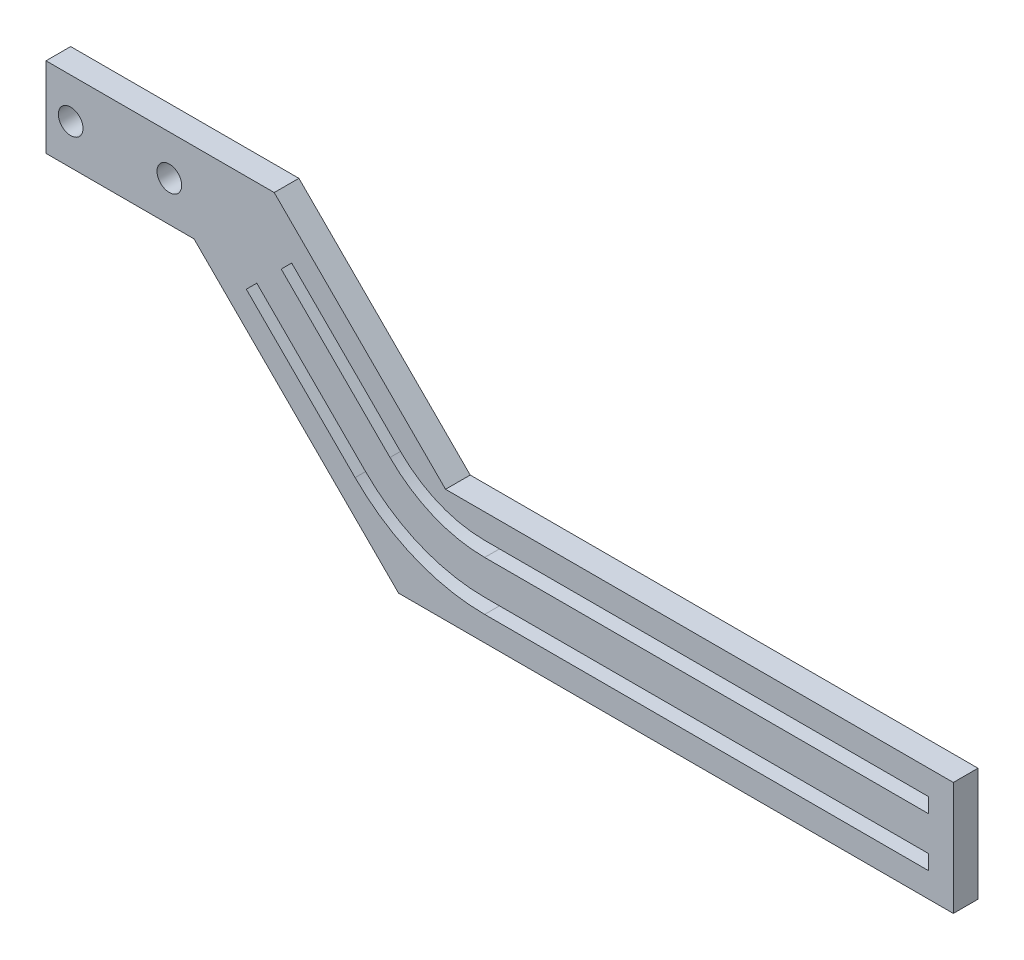
ISO-10303-21;
HEADER;
FILE_DESCRIPTION(('STEP AP214'),'2;1');
FILE_NAME('part.step','',(''),(''),'','','');
FILE_SCHEMA(('AUTOMOTIVE_DESIGN { 1 0 10303 214 1 1 1 1 }'));
ENDSEC;
DATA;
#1=APPLICATION_CONTEXT('core data for automotive mechanical design processes');
#2=APPLICATION_PROTOCOL_DEFINITION('international standard','automotive_design',2000,#1);
#3=PRODUCT_CONTEXT('',#1,'mechanical');
#4=PRODUCT('Part','Part','',(#3));
#5=PRODUCT_RELATED_PRODUCT_CATEGORY('part','',(#4));
#6=PRODUCT_DEFINITION_FORMATION('','',#4);
#7=PRODUCT_DEFINITION_CONTEXT('part definition',#1,'design');
#8=PRODUCT_DEFINITION('design','',#6,#7);
#9=PRODUCT_DEFINITION_SHAPE('','',#8);
#10=(LENGTH_UNIT() NAMED_UNIT(*) SI_UNIT(.MILLI.,.METRE.));
#11=(NAMED_UNIT(*) PLANE_ANGLE_UNIT() SI_UNIT($,.RADIAN.));
#12=(NAMED_UNIT(*) SI_UNIT($,.STERADIAN.) SOLID_ANGLE_UNIT());
#13=UNCERTAINTY_MEASURE_WITH_UNIT(LENGTH_MEASURE(1.E-05),#10,'distance_accuracy_value','');
#14=(GEOMETRIC_REPRESENTATION_CONTEXT(3) GLOBAL_UNCERTAINTY_ASSIGNED_CONTEXT((#13)) GLOBAL_UNIT_ASSIGNED_CONTEXT((#10,
#11,#12)) REPRESENTATION_CONTEXT('',''));
#15=CARTESIAN_POINT('',(0.,0.,0.));
#16=DIRECTION('',(0.,0.,1.));
#17=DIRECTION('',(1.,0.,0.));
#18=AXIS2_PLACEMENT_3D('',#15,#16,#17);
#19=CARTESIAN_POINT('',(0.,0.,5.));
#20=DIRECTION('',(0.,0.,-1.));
#21=DIRECTION('',(-1.,0.,0.));
#22=AXIS2_PLACEMENT_3D('',#19,#20,#21);
#23=PLANE('',#22);
#24=DIRECTION('',(-0.707106781186554,-0.707106781186541,0.));
#25=VECTOR('',#24,1.);
#26=CARTESIAN_POINT('',(-29.9999999999996,30.,5.));
#27=LINE('',#26,#25);
#28=CARTESIAN_POINT('',(-27.8786796564399,32.1213203435596,5.));
#29=VERTEX_POINT('',#28);
#30=CARTESIAN_POINT('',(-29.9999999999996,30.,5.));
#31=VERTEX_POINT('',#30);
#32=EDGE_CURVE('E263',#29,#31,#27,.T.);
#33=ORIENTED_EDGE('',*,*,#32,.F.);
#34=DIRECTION('',(-0.707106781186543,0.707106781186552,0.));
#35=VECTOR('',#34,1.);
#36=CARTESIAN_POINT('',(-27.8786796564399,32.1213203435596,5.));
#37=LINE('',#36,#35);
#38=CARTESIAN_POINT('',(-5.82842712474613,10.0710678118655,5.));
#39=VERTEX_POINT('',#38);
#40=EDGE_CURVE('E279',#39,#29,#37,.T.);
#41=ORIENTED_EDGE('',*,*,#40,.F.);
#42=CARTESIAN_POINT('',(11.2426406871193,27.1421356237307,5.));
#43=DIRECTION('',(0.,0.,-1.));
#44=DIRECTION('',(-1.,0.,0.));
#45=AXIS2_PLACEMENT_3D('',#42,#43,#44);
#46=CIRCLE('',#45,24.1421356237307);
#47=CARTESIAN_POINT('',(11.2426406871193,3.,5.));
#48=VERTEX_POINT('',#47);
#49=EDGE_CURVE('E276',#48,#39,#46,.T.);
#50=ORIENTED_EDGE('',*,*,#49,.F.);
#51=DIRECTION('',(-1.,0.,0.));
#52=VECTOR('',#51,1.);
#53=CARTESIAN_POINT('',(11.2426406871193,3.,5.));
#54=LINE('',#53,#52);
#55=CARTESIAN_POINT('',(101.242640687119,3.,5.));
#56=VERTEX_POINT('',#55);
#57=EDGE_CURVE('E274',#56,#48,#54,.T.);
#58=ORIENTED_EDGE('',*,*,#57,.F.);
#59=DIRECTION('',(0.,1.,0.));
#60=VECTOR('',#59,1.);
#61=CARTESIAN_POINT('',(101.242640687119,3.,5.));
#62=LINE('',#61,#60);
#63=CARTESIAN_POINT('',(101.242640687119,0.,5.));
#64=VERTEX_POINT('',#63);
#65=EDGE_CURVE('E272',#64,#56,#62,.T.);
#66=ORIENTED_EDGE('',*,*,#65,.F.);
#67=DIRECTION('',(1.,0.,0.));
#68=VECTOR('',#67,1.);
#69=CARTESIAN_POINT('',(101.242640687119,0.,5.));
#70=LINE('',#69,#68);
#71=CARTESIAN_POINT('',(11.2426406871193,0.,5.));
#72=VERTEX_POINT('',#71);
#73=EDGE_CURVE('E270',#72,#64,#70,.T.);
#74=ORIENTED_EDGE('',*,*,#73,.F.);
#75=CARTESIAN_POINT('',(11.2426406871193,27.1421356237307,5.));
#76=DIRECTION('',(0.,0.,1.));
#77=DIRECTION('',(-1.,0.,0.));
#78=AXIS2_PLACEMENT_3D('',#75,#76,#77);
#79=CIRCLE('',#78,27.1421356237307);
#80=CARTESIAN_POINT('',(-7.94974746830579,7.94974746830589,5.));
#81=VERTEX_POINT('',#80);
#82=EDGE_CURVE('E268',#81,#72,#79,.T.);
#83=ORIENTED_EDGE('',*,*,#82,.F.);
#84=DIRECTION('',(0.707106781186543,-0.707106781186552,0.));
#85=VECTOR('',#84,1.);
#86=CARTESIAN_POINT('',(-7.94974746830578,7.94974746830589,5.));
#87=LINE('',#86,#85);
#88=EDGE_CURVE('E265',#31,#81,#87,.T.);
#89=ORIENTED_EDGE('',*,*,#88,.F.);
#90=EDGE_LOOP('',(#33,#41,#50,#58,#66,#74,#83,#89));
#91=FACE_BOUND('',#90,.T.);
#92=DIRECTION('',(1.,0.,0.));
#93=VECTOR('',#92,1.);
#94=CARTESIAN_POINT('',(-77.6776695296633,26.4644660940673,5.));
#95=LINE('',#94,#93);
#96=CARTESIAN_POINT('',(-77.6776695296633,26.4644660940673,5.));
#97=VERTEX_POINT('',#96);
#98=CARTESIAN_POINT('',(-47.6776695296633,26.4644660940673,5.));
#99=VERTEX_POINT('',#98);
#100=EDGE_CURVE('E322',#97,#99,#95,.T.);
#101=ORIENTED_EDGE('',*,*,#100,.T.);
#102=DIRECTION('',(0.707106781186544,-0.707106781186551,0.));
#103=VECTOR('',#102,1.);
#104=CARTESIAN_POINT('',(-6.21320343559643,-15.,5.));
#105=LINE('',#104,#103);
#106=CARTESIAN_POINT('',(-6.21320343559643,-15.,5.));
#107=VERTEX_POINT('',#106);
#108=EDGE_CURVE('E325',#99,#107,#105,.T.);
#109=ORIENTED_EDGE('',*,*,#108,.T.);
#110=DIRECTION('',(1.,0.,0.));
#111=VECTOR('',#110,1.);
#112=CARTESIAN_POINT('',(106.242640687119,-15.,5.));
#113=LINE('',#112,#111);
#114=CARTESIAN_POINT('',(106.242640687119,-15.,5.));
#115=VERTEX_POINT('',#114);
#116=EDGE_CURVE('E328',#107,#115,#113,.T.);
#117=ORIENTED_EDGE('',*,*,#116,.T.);
#118=DIRECTION('',(0.,1.,0.));
#119=VECTOR('',#118,1.);
#120=CARTESIAN_POINT('',(106.242640687119,8.,5.));
#121=LINE('',#120,#119);
#122=CARTESIAN_POINT('',(106.242640687119,8.,5.));
#123=VERTEX_POINT('',#122);
#124=EDGE_CURVE('E330',#115,#123,#121,.T.);
#125=ORIENTED_EDGE('',*,*,#124,.T.);
#126=DIRECTION('',(-1.,0.,0.));
#127=VECTOR('',#126,1.);
#128=CARTESIAN_POINT('',(3.3137084989848,8.,5.));
#129=LINE('',#128,#127);
#130=CARTESIAN_POINT('',(3.3137084989848,8.,5.));
#131=VERTEX_POINT('',#130);
#132=EDGE_CURVE('E332',#123,#131,#129,.T.);
#133=ORIENTED_EDGE('',*,*,#132,.T.);
#134=DIRECTION('',(-0.707106781186543,0.707106781186552,0.));
#135=VECTOR('',#134,1.);
#136=CARTESIAN_POINT('',(-31.4142135623726,42.7279220613579,5.));
#137=LINE('',#136,#135);
#138=CARTESIAN_POINT('',(-31.4142135623726,42.7279220613579,5.));
#139=VERTEX_POINT('',#138);
#140=EDGE_CURVE('E334',#131,#139,#137,.T.);
#141=ORIENTED_EDGE('',*,*,#140,.T.);
#142=DIRECTION('',(-1.,0.,0.));
#143=VECTOR('',#142,1.);
#144=CARTESIAN_POINT('',(-31.4142135623726,42.7279220613579,5.));
#145=LINE('',#144,#143);
#146=CARTESIAN_POINT('',(-77.6776695296633,42.7279220613578,5.));
#147=VERTEX_POINT('',#146);
#148=EDGE_CURVE('E336',#139,#147,#145,.T.);
#149=ORIENTED_EDGE('',*,*,#148,.T.);
#150=DIRECTION('',(0.,-1.,0.));
#151=VECTOR('',#150,1.);
#152=CARTESIAN_POINT('',(-77.6776695296633,42.7279220613578,5.));
#153=LINE('',#152,#151);
#154=EDGE_CURVE('E338',#147,#97,#153,.T.);
#155=ORIENTED_EDGE('',*,*,#154,.T.);
#156=EDGE_LOOP('',(#101,#109,#117,#125,#133,#141,#149,#155));
#157=FACE_BOUND('',#156,.T.);
#158=DIRECTION('',(-0.707106781186553,-0.707106781186542,0.));
#159=VECTOR('',#158,1.);
#160=CARTESIAN_POINT('',(-37.0710678118651,22.9289321881346,5.));
#161=LINE('',#160,#159);
#162=CARTESIAN_POINT('',(-34.9497474683055,25.0502525316942,5.));
#163=VERTEX_POINT('',#162);
#164=CARTESIAN_POINT('',(-37.0710678118651,22.9289321881346,5.));
#165=VERTEX_POINT('',#164);
#166=EDGE_CURVE('E195',#163,#165,#161,.T.);
#167=ORIENTED_EDGE('',*,*,#166,.F.);
#168=DIRECTION('',(-0.707106781186543,0.707106781186552,0.));
#169=VECTOR('',#168,1.);
#170=CARTESIAN_POINT('',(-34.9497474683055,25.0502525316942,5.));
#171=LINE('',#170,#169);
#172=CARTESIAN_POINT('',(-12.8994949366117,3.0000000000001,5.));
#173=VERTEX_POINT('',#172);
#174=EDGE_CURVE('E230',#173,#163,#171,.T.);
#175=ORIENTED_EDGE('',*,*,#174,.F.);
#176=CARTESIAN_POINT('',(11.2426406871193,27.1421356237307,5.));
#177=DIRECTION('',(0.,0.,-1.));
#178=DIRECTION('',(1.,0.,0.));
#179=AXIS2_PLACEMENT_3D('',#176,#177,#178);
#180=CIRCLE('',#179,34.1421356237307);
#181=CARTESIAN_POINT('',(11.2426406871193,-7.,5.));
#182=VERTEX_POINT('',#181);
#183=EDGE_CURVE('E228',#182,#173,#180,.T.);
#184=ORIENTED_EDGE('',*,*,#183,.F.);
#185=DIRECTION('',(-1.,0.,0.));
#186=VECTOR('',#185,1.);
#187=CARTESIAN_POINT('',(11.2426406871193,-7.,5.));
#188=LINE('',#187,#186);
#189=CARTESIAN_POINT('',(101.242640687119,-7.,5.));
#190=VERTEX_POINT('',#189);
#191=EDGE_CURVE('E226',#190,#182,#188,.T.);
#192=ORIENTED_EDGE('',*,*,#191,.F.);
#193=DIRECTION('',(0.,1.,0.));
#194=VECTOR('',#193,1.);
#195=CARTESIAN_POINT('',(101.242640687119,-7.,5.));
#196=LINE('',#195,#194);
#197=CARTESIAN_POINT('',(101.242640687119,-9.99999999999999,5.));
#198=VERTEX_POINT('',#197);
#199=EDGE_CURVE('E224',#198,#190,#196,.T.);
#200=ORIENTED_EDGE('',*,*,#199,.F.);
#201=DIRECTION('',(1.,0.,0.));
#202=VECTOR('',#201,1.);
#203=CARTESIAN_POINT('',(101.242640687119,-9.99999999999999,5.));
#204=LINE('',#203,#202);
#205=CARTESIAN_POINT('',(11.2426406871193,-10.,5.));
#206=VERTEX_POINT('',#205);
#207=EDGE_CURVE('E219',#206,#198,#204,.T.);
#208=ORIENTED_EDGE('',*,*,#207,.F.);
#209=CARTESIAN_POINT('',(11.2426406871193,27.1421356237307,5.));
#210=DIRECTION('',(0.,0.,1.));
#211=DIRECTION('',(-1.,0.,0.));
#212=AXIS2_PLACEMENT_3D('',#209,#210,#211);
#213=CIRCLE('',#212,37.1421356237307);
#214=CARTESIAN_POINT('',(-15.0208152801713,0.878679656440472,5.));
#215=VERTEX_POINT('',#214);
#216=EDGE_CURVE('E217',#215,#206,#213,.T.);
#217=ORIENTED_EDGE('',*,*,#216,.F.);
#218=DIRECTION('',(0.707106781186543,-0.707106781186552,0.));
#219=VECTOR('',#218,1.);
#220=CARTESIAN_POINT('',(-15.0208152801713,0.878679656440465,5.));
#221=LINE('',#220,#219);
#222=EDGE_CURVE('E203',#165,#215,#221,.T.);
#223=ORIENTED_EDGE('',*,*,#222,.F.);
#224=EDGE_LOOP('',(#167,#175,#184,#192,#200,#208,#217,#223));
#225=FACE_BOUND('',#224,.T.);
#226=CARTESIAN_POINT('',(-72.6776695296633,34.5961940777126,5.));
#227=DIRECTION('',(0.,0.,1.));
#228=DIRECTION('',(1.,0.,0.));
#229=AXIS2_PLACEMENT_3D('',#226,#227,#228);
#230=CIRCLE('',#229,2.5);
#231=CARTESIAN_POINT('',(-70.1776695296633,34.5961940777126,5.));
#232=VERTEX_POINT('',#231);
#233=EDGE_CURVE('E233',#232,#232,#230,.T.);
#234=ORIENTED_EDGE('',*,*,#233,.F.);
#235=EDGE_LOOP('',(#234));
#236=FACE_BOUND('',#235,.T.);
#237=CARTESIAN_POINT('',(-52.6776695296633,34.5961940777126,5.));
#238=DIRECTION('',(0.,0.,1.));
#239=DIRECTION('',(1.,0.,0.));
#240=AXIS2_PLACEMENT_3D('',#237,#238,#239);
#241=CIRCLE('',#240,2.5);
#242=CARTESIAN_POINT('',(-50.1776695296633,34.5961940777126,5.));
#243=VERTEX_POINT('',#242);
#244=EDGE_CURVE('E622',#243,#243,#241,.T.);
#245=ORIENTED_EDGE('',*,*,#244,.F.);
#246=EDGE_LOOP('',(#245));
#247=FACE_BOUND('',#246,.T.);
#248=ADVANCED_FACE('F34',(#91,#157,#225,#236,#247),#23,.F.);
#249=CARTESIAN_POINT('',(0.,0.,0.));
#250=DIRECTION('',(0.,0.,-1.));
#251=DIRECTION('',(-1.,0.,0.));
#252=AXIS2_PLACEMENT_3D('',#249,#250,#251);
#253=PLANE('',#252);
#254=CARTESIAN_POINT('',(-72.6776695296633,34.5961940777126,0.));
#255=DIRECTION('',(0.,0.,1.));
#256=DIRECTION('',(1.,0.,0.));
#257=AXIS2_PLACEMENT_3D('',#254,#255,#256);
#258=CIRCLE('',#257,2.5);
#259=CARTESIAN_POINT('',(-70.1776695296633,34.5961940777126,0.));
#260=VERTEX_POINT('',#259);
#261=EDGE_CURVE('E628',#260,#260,#258,.T.);
#262=ORIENTED_EDGE('',*,*,#261,.T.);
#263=EDGE_LOOP('',(#262));
#264=FACE_BOUND('',#263,.T.);
#265=DIRECTION('',(1.,0.,0.));
#266=VECTOR('',#265,1.);
#267=CARTESIAN_POINT('',(-77.6776695296633,26.4644660940673,0.));
#268=LINE('',#267,#266);
#269=CARTESIAN_POINT('',(-77.6776695296633,26.4644660940673,0.));
#270=VERTEX_POINT('',#269);
#271=CARTESIAN_POINT('',(-47.6776695296633,26.4644660940673,0.));
#272=VERTEX_POINT('',#271);
#273=EDGE_CURVE('E321',#270,#272,#268,.T.);
#274=ORIENTED_EDGE('',*,*,#273,.F.);
#275=DIRECTION('',(0.,-1.,0.));
#276=VECTOR('',#275,1.);
#277=CARTESIAN_POINT('',(-77.6776695296633,42.7279220613578,0.));
#278=LINE('',#277,#276);
#279=CARTESIAN_POINT('',(-77.6776695296633,42.7279220613578,0.));
#280=VERTEX_POINT('',#279);
#281=EDGE_CURVE('E326',#280,#270,#278,.T.);
#282=ORIENTED_EDGE('',*,*,#281,.F.);
#283=DIRECTION('',(-1.,0.,0.));
#284=VECTOR('',#283,1.);
#285=CARTESIAN_POINT('',(-31.4142135623726,42.7279220613579,0.));
#286=LINE('',#285,#284);
#287=CARTESIAN_POINT('',(-31.4142135623726,42.7279220613579,0.));
#288=VERTEX_POINT('',#287);
#289=EDGE_CURVE('E353',#288,#280,#286,.T.);
#290=ORIENTED_EDGE('',*,*,#289,.F.);
#291=DIRECTION('',(-0.707106781186543,0.707106781186552,0.));
#292=VECTOR('',#291,1.);
#293=CARTESIAN_POINT('',(-31.4142135623726,42.7279220613579,0.));
#294=LINE('',#293,#292);
#295=CARTESIAN_POINT('',(3.3137084989848,8.,0.));
#296=VERTEX_POINT('',#295);
#297=EDGE_CURVE('E351',#296,#288,#294,.T.);
#298=ORIENTED_EDGE('',*,*,#297,.F.);
#299=DIRECTION('',(-1.,0.,0.));
#300=VECTOR('',#299,1.);
#301=CARTESIAN_POINT('',(3.3137084989848,8.,0.));
#302=LINE('',#301,#300);
#303=CARTESIAN_POINT('',(106.242640687119,8.,0.));
#304=VERTEX_POINT('',#303);
#305=EDGE_CURVE('E349',#304,#296,#302,.T.);
#306=ORIENTED_EDGE('',*,*,#305,.F.);
#307=DIRECTION('',(0.,1.,0.));
#308=VECTOR('',#307,1.);
#309=CARTESIAN_POINT('',(106.242640687119,8.,0.));
#310=LINE('',#309,#308);
#311=CARTESIAN_POINT('',(106.242640687119,-15.,0.));
#312=VERTEX_POINT('',#311);
#313=EDGE_CURVE('E347',#312,#304,#310,.T.);
#314=ORIENTED_EDGE('',*,*,#313,.F.);
#315=DIRECTION('',(1.,0.,0.));
#316=VECTOR('',#315,1.);
#317=CARTESIAN_POINT('',(106.242640687119,-15.,0.));
#318=LINE('',#317,#316);
#319=CARTESIAN_POINT('',(-6.21320343559643,-15.,0.));
#320=VERTEX_POINT('',#319);
#321=EDGE_CURVE('E345',#320,#312,#318,.T.);
#322=ORIENTED_EDGE('',*,*,#321,.F.);
#323=DIRECTION('',(0.707106781186544,-0.707106781186551,0.));
#324=VECTOR('',#323,1.);
#325=CARTESIAN_POINT('',(-6.21320343559643,-15.,0.));
#326=LINE('',#325,#324);
#327=EDGE_CURVE('E343',#272,#320,#326,.T.);
#328=ORIENTED_EDGE('',*,*,#327,.F.);
#329=EDGE_LOOP('',(#274,#282,#290,#298,#306,#314,#322,#328));
#330=FACE_BOUND('',#329,.T.);
#331=DIRECTION('',(-0.707106781186543,0.707106781186552,0.));
#332=VECTOR('',#331,1.);
#333=CARTESIAN_POINT('',(-27.8786796564399,32.1213203435596,0.));
#334=LINE('',#333,#332);
#335=CARTESIAN_POINT('',(-5.82842712474613,10.0710678118655,0.));
#336=VERTEX_POINT('',#335);
#337=CARTESIAN_POINT('',(-27.8786796564399,32.1213203435596,0.));
#338=VERTEX_POINT('',#337);
#339=EDGE_CURVE('E266',#336,#338,#334,.T.);
#340=ORIENTED_EDGE('',*,*,#339,.T.);
#341=DIRECTION('',(-0.707106781186554,-0.707106781186541,0.));
#342=VECTOR('',#341,1.);
#343=CARTESIAN_POINT('',(-29.9999999999996,30.,0.));
#344=LINE('',#343,#342);
#345=CARTESIAN_POINT('',(-29.9999999999996,30.,0.));
#346=VERTEX_POINT('',#345);
#347=EDGE_CURVE('E211',#338,#346,#344,.T.);
#348=ORIENTED_EDGE('',*,*,#347,.T.);
#349=DIRECTION('',(0.707106781186543,-0.707106781186552,0.));
#350=VECTOR('',#349,1.);
#351=CARTESIAN_POINT('',(-7.94974746830578,7.94974746830589,0.));
#352=LINE('',#351,#350);
#353=CARTESIAN_POINT('',(-7.94974746830579,7.94974746830589,0.));
#354=VERTEX_POINT('',#353);
#355=EDGE_CURVE('E284',#346,#354,#352,.T.);
#356=ORIENTED_EDGE('',*,*,#355,.T.);
#357=CARTESIAN_POINT('',(11.2426406871193,27.1421356237307,0.));
#358=DIRECTION('',(0.,0.,1.));
#359=DIRECTION('',(-1.,0.,0.));
#360=AXIS2_PLACEMENT_3D('',#357,#358,#359);
#361=CIRCLE('',#360,27.1421356237307);
#362=CARTESIAN_POINT('',(11.2426406871193,0.,0.));
#363=VERTEX_POINT('',#362);
#364=EDGE_CURVE('E287',#354,#363,#361,.T.);
#365=ORIENTED_EDGE('',*,*,#364,.T.);
#366=DIRECTION('',(1.,0.,0.));
#367=VECTOR('',#366,1.);
#368=CARTESIAN_POINT('',(101.242640687119,0.,0.));
#369=LINE('',#368,#367);
#370=CARTESIAN_POINT('',(101.242640687119,0.,0.));
#371=VERTEX_POINT('',#370);
#372=EDGE_CURVE('E290',#363,#371,#369,.T.);
#373=ORIENTED_EDGE('',*,*,#372,.T.);
#374=DIRECTION('',(0.,1.,0.));
#375=VECTOR('',#374,1.);
#376=CARTESIAN_POINT('',(101.242640687119,3.,0.));
#377=LINE('',#376,#375);
#378=CARTESIAN_POINT('',(101.242640687119,3.,0.));
#379=VERTEX_POINT('',#378);
#380=EDGE_CURVE('E293',#371,#379,#377,.T.);
#381=ORIENTED_EDGE('',*,*,#380,.T.);
#382=DIRECTION('',(-1.,0.,0.));
#383=VECTOR('',#382,1.);
#384=CARTESIAN_POINT('',(11.2426406871193,3.,0.));
#385=LINE('',#384,#383);
#386=CARTESIAN_POINT('',(11.2426406871193,3.,0.));
#387=VERTEX_POINT('',#386);
#388=EDGE_CURVE('E296',#379,#387,#385,.T.);
#389=ORIENTED_EDGE('',*,*,#388,.T.);
#390=CARTESIAN_POINT('',(11.2426406871193,27.1421356237307,0.));
#391=DIRECTION('',(0.,0.,-1.));
#392=DIRECTION('',(-1.,0.,0.));
#393=AXIS2_PLACEMENT_3D('',#390,#391,#392);
#394=CIRCLE('',#393,24.1421356237307);
#395=EDGE_CURVE('E299',#387,#336,#394,.T.);
#396=ORIENTED_EDGE('',*,*,#395,.T.);
#397=EDGE_LOOP('',(#340,#348,#356,#365,#373,#381,#389,#396));
#398=FACE_BOUND('',#397,.T.);
#399=DIRECTION('',(-0.707106781186543,0.707106781186552,0.));
#400=VECTOR('',#399,1.);
#401=CARTESIAN_POINT('',(-34.9497474683055,25.0502525316942,0.));
#402=LINE('',#401,#400);
#403=CARTESIAN_POINT('',(-12.8994949366117,3.0000000000001,0.));
#404=VERTEX_POINT('',#403);
#405=CARTESIAN_POINT('',(-34.9497474683055,25.0502525316942,0.));
#406=VERTEX_POINT('',#405);
#407=EDGE_CURVE('E204',#404,#406,#402,.T.);
#408=ORIENTED_EDGE('',*,*,#407,.T.);
#409=DIRECTION('',(-0.707106781186553,-0.707106781186542,0.));
#410=VECTOR('',#409,1.);
#411=CARTESIAN_POINT('',(-37.0710678118651,22.9289321881346,0.));
#412=LINE('',#411,#410);
#413=CARTESIAN_POINT('',(-37.0710678118651,22.9289321881346,0.));
#414=VERTEX_POINT('',#413);
#415=EDGE_CURVE('E57',#406,#414,#412,.T.);
#416=ORIENTED_EDGE('',*,*,#415,.T.);
#417=DIRECTION('',(0.707106781186543,-0.707106781186552,0.));
#418=VECTOR('',#417,1.);
#419=CARTESIAN_POINT('',(-15.0208152801713,0.878679656440465,0.));
#420=LINE('',#419,#418);
#421=CARTESIAN_POINT('',(-15.0208152801713,0.878679656440472,0.));
#422=VERTEX_POINT('',#421);
#423=EDGE_CURVE('E210',#414,#422,#420,.T.);
#424=ORIENTED_EDGE('',*,*,#423,.T.);
#425=CARTESIAN_POINT('',(11.2426406871193,27.1421356237307,0.));
#426=DIRECTION('',(0.,0.,1.));
#427=DIRECTION('',(-1.,0.,0.));
#428=AXIS2_PLACEMENT_3D('',#425,#426,#427);
#429=CIRCLE('',#428,37.1421356237307);
#430=CARTESIAN_POINT('',(11.2426406871193,-10.,0.));
#431=VERTEX_POINT('',#430);
#432=EDGE_CURVE('E235',#422,#431,#429,.T.);
#433=ORIENTED_EDGE('',*,*,#432,.T.);
#434=DIRECTION('',(1.,0.,0.));
#435=VECTOR('',#434,1.);
#436=CARTESIAN_POINT('',(101.242640687119,-9.99999999999999,0.));
#437=LINE('',#436,#435);
#438=CARTESIAN_POINT('',(101.242640687119,-9.99999999999999,0.));
#439=VERTEX_POINT('',#438);
#440=EDGE_CURVE('E238',#431,#439,#437,.T.);
#441=ORIENTED_EDGE('',*,*,#440,.T.);
#442=DIRECTION('',(0.,1.,0.));
#443=VECTOR('',#442,1.);
#444=CARTESIAN_POINT('',(101.242640687119,-7.,0.));
#445=LINE('',#444,#443);
#446=CARTESIAN_POINT('',(101.242640687119,-7.,0.));
#447=VERTEX_POINT('',#446);
#448=EDGE_CURVE('E241',#439,#447,#445,.T.);
#449=ORIENTED_EDGE('',*,*,#448,.T.);
#450=DIRECTION('',(-1.,0.,0.));
#451=VECTOR('',#450,1.);
#452=CARTESIAN_POINT('',(11.2426406871193,-7.,0.));
#453=LINE('',#452,#451);
#454=CARTESIAN_POINT('',(11.2426406871193,-7.,0.));
#455=VERTEX_POINT('',#454);
#456=EDGE_CURVE('E244',#447,#455,#453,.T.);
#457=ORIENTED_EDGE('',*,*,#456,.T.);
#458=CARTESIAN_POINT('',(11.2426406871193,27.1421356237307,0.));
#459=DIRECTION('',(0.,0.,-1.));
#460=DIRECTION('',(1.,0.,0.));
#461=AXIS2_PLACEMENT_3D('',#458,#459,#460);
#462=CIRCLE('',#461,34.1421356237307);
#463=EDGE_CURVE('E247',#455,#404,#462,.T.);
#464=ORIENTED_EDGE('',*,*,#463,.T.);
#465=EDGE_LOOP('',(#408,#416,#424,#433,#441,#449,#457,#464));
#466=FACE_BOUND('',#465,.T.);
#467=CARTESIAN_POINT('',(-52.6776695296633,34.5961940777126,0.));
#468=DIRECTION('',(0.,0.,1.));
#469=DIRECTION('',(1.,0.,0.));
#470=AXIS2_PLACEMENT_3D('',#467,#468,#469);
#471=CIRCLE('',#470,2.5);
#472=CARTESIAN_POINT('',(-50.1776695296633,34.5961940777126,0.));
#473=VERTEX_POINT('',#472);
#474=EDGE_CURVE('E625',#473,#473,#471,.T.);
#475=ORIENTED_EDGE('',*,*,#474,.T.);
#476=EDGE_LOOP('',(#475));
#477=FACE_BOUND('',#476,.T.);
#478=ADVANCED_FACE('F383',(#264,#330,#398,#466,#477),#253,.T.);
#479=CARTESIAN_POINT('',(-77.6776695296633,26.4644660940673,5.));
#480=DIRECTION('',(0.,1.,0.));
#481=DIRECTION('',(0.,0.,1.));
#482=AXIS2_PLACEMENT_3D('',#479,#480,#481);
#483=PLANE('',#482);
#484=ORIENTED_EDGE('',*,*,#273,.T.);
#485=DIRECTION('',(0.,0.,-1.));
#486=VECTOR('',#485,1.);
#487=CARTESIAN_POINT('',(-47.6776695296633,26.4644660940673,5.));
#488=LINE('',#487,#486);
#489=EDGE_CURVE('E11',#99,#272,#488,.T.);
#490=ORIENTED_EDGE('',*,*,#489,.F.);
#491=ORIENTED_EDGE('',*,*,#100,.F.);
#492=DIRECTION('',(0.,0.,-1.));
#493=VECTOR('',#492,1.);
#494=CARTESIAN_POINT('',(-77.6776695296633,26.4644660940673,5.));
#495=LINE('',#494,#493);
#496=EDGE_CURVE('E340',#97,#270,#495,.T.);
#497=ORIENTED_EDGE('',*,*,#496,.T.);
#498=EDGE_LOOP('',(#484,#490,#491,#497));
#499=FACE_BOUND('',#498,.T.);
#500=ADVANCED_FACE('F36',(#499),#483,.F.);
#501=CARTESIAN_POINT('',(-6.21320343559643,-15.,5.));
#502=DIRECTION('',(0.707106781186551,0.707106781186544,0.));
#503=DIRECTION('',(-0.707106781186544,0.707106781186551,0.));
#504=AXIS2_PLACEMENT_3D('',#501,#502,#503);
#505=PLANE('',#504);
#506=ORIENTED_EDGE('',*,*,#327,.T.);
#507=DIRECTION('',(0.,0.,-1.));
#508=VECTOR('',#507,1.);
#509=CARTESIAN_POINT('',(-6.21320343559643,-15.,5.));
#510=LINE('',#509,#508);
#511=EDGE_CURVE('E42',#107,#320,#510,.T.);
#512=ORIENTED_EDGE('',*,*,#511,.F.);
#513=ORIENTED_EDGE('',*,*,#108,.F.);
#514=ORIENTED_EDGE('',*,*,#489,.T.);
#515=EDGE_LOOP('',(#506,#512,#513,#514));
#516=FACE_BOUND('',#515,.T.);
#517=ADVANCED_FACE('F400',(#516),#505,.F.);
#518=CARTESIAN_POINT('',(106.242640687119,-15.,5.));
#519=DIRECTION('',(0.,1.,0.));
#520=DIRECTION('',(-1.,0.,0.));
#521=AXIS2_PLACEMENT_3D('',#518,#519,#520);
#522=PLANE('',#521);
#523=ORIENTED_EDGE('',*,*,#321,.T.);
#524=DIRECTION('',(0.,0.,-1.));
#525=VECTOR('',#524,1.);
#526=CARTESIAN_POINT('',(106.242640687119,-15.,5.));
#527=LINE('',#526,#525);
#528=EDGE_CURVE('E370',#115,#312,#527,.T.);
#529=ORIENTED_EDGE('',*,*,#528,.F.);
#530=ORIENTED_EDGE('',*,*,#116,.F.);
#531=ORIENTED_EDGE('',*,*,#511,.T.);
#532=EDGE_LOOP('',(#523,#529,#530,#531));
#533=FACE_BOUND('',#532,.T.);
#534=ADVANCED_FACE('F377',(#533),#522,.F.);
#535=CARTESIAN_POINT('',(106.242640687119,8.,5.));
#536=DIRECTION('',(-1.,0.,0.));
#537=DIRECTION('',(0.,0.,1.));
#538=AXIS2_PLACEMENT_3D('',#535,#536,#537);
#539=PLANE('',#538);
#540=ORIENTED_EDGE('',*,*,#313,.T.);
#541=DIRECTION('',(0.,0.,-1.));
#542=VECTOR('',#541,1.);
#543=CARTESIAN_POINT('',(106.242640687119,8.,5.));
#544=LINE('',#543,#542);
#545=EDGE_CURVE('E367',#123,#304,#544,.T.);
#546=ORIENTED_EDGE('',*,*,#545,.F.);
#547=ORIENTED_EDGE('',*,*,#124,.F.);
#548=ORIENTED_EDGE('',*,*,#528,.T.);
#549=EDGE_LOOP('',(#540,#546,#547,#548));
#550=FACE_BOUND('',#549,.T.);
#551=ADVANCED_FACE('F389',(#550),#539,.F.);
#552=CARTESIAN_POINT('',(3.3137084989848,8.,5.));
#553=DIRECTION('',(0.,-1.,0.));
#554=DIRECTION('',(0.,0.,-1.));
#555=AXIS2_PLACEMENT_3D('',#552,#553,#554);
#556=PLANE('',#555);
#557=ORIENTED_EDGE('',*,*,#305,.T.);
#558=DIRECTION('',(0.,0.,-1.));
#559=VECTOR('',#558,1.);
#560=CARTESIAN_POINT('',(3.3137084989848,8.,5.));
#561=LINE('',#560,#559);
#562=EDGE_CURVE('E364',#131,#296,#561,.T.);
#563=ORIENTED_EDGE('',*,*,#562,.F.);
#564=ORIENTED_EDGE('',*,*,#132,.F.);
#565=ORIENTED_EDGE('',*,*,#545,.T.);
#566=EDGE_LOOP('',(#557,#563,#564,#565));
#567=FACE_BOUND('',#566,.T.);
#568=ADVANCED_FACE('F393',(#567),#556,.F.);
#569=CARTESIAN_POINT('',(-31.4142135623726,42.7279220613579,5.));
#570=DIRECTION('',(-0.707106781186552,-0.707106781186543,0.));
#571=DIRECTION('',(0.707106781186543,-0.707106781186552,0.));
#572=AXIS2_PLACEMENT_3D('',#569,#570,#571);
#573=PLANE('',#572);
#574=ORIENTED_EDGE('',*,*,#297,.T.);
#575=DIRECTION('',(0.,0.,-1.));
#576=VECTOR('',#575,1.);
#577=CARTESIAN_POINT('',(-31.4142135623726,42.7279220613579,5.));
#578=LINE('',#577,#576);
#579=EDGE_CURVE('E361',#139,#288,#578,.T.);
#580=ORIENTED_EDGE('',*,*,#579,.F.);
#581=ORIENTED_EDGE('',*,*,#140,.F.);
#582=ORIENTED_EDGE('',*,*,#562,.T.);
#583=EDGE_LOOP('',(#574,#580,#581,#582));
#584=FACE_BOUND('',#583,.T.);
#585=ADVANCED_FACE('F413',(#584),#573,.F.);
#586=CARTESIAN_POINT('',(-31.4142135623726,42.7279220613579,5.));
#587=DIRECTION('',(0.,-1.,0.));
#588=DIRECTION('',(1.,0.,0.));
#589=AXIS2_PLACEMENT_3D('',#586,#587,#588);
#590=PLANE('',#589);
#591=ORIENTED_EDGE('',*,*,#289,.T.);
#592=DIRECTION('',(0.,0.,-1.));
#593=VECTOR('',#592,1.);
#594=CARTESIAN_POINT('',(-77.6776695296633,42.7279220613578,5.));
#595=LINE('',#594,#593);
#596=EDGE_CURVE('E358',#147,#280,#595,.T.);
#597=ORIENTED_EDGE('',*,*,#596,.F.);
#598=ORIENTED_EDGE('',*,*,#148,.F.);
#599=ORIENTED_EDGE('',*,*,#579,.T.);
#600=EDGE_LOOP('',(#591,#597,#598,#599));
#601=FACE_BOUND('',#600,.T.);
#602=ADVANCED_FACE('F411',(#601),#590,.F.);
#603=CARTESIAN_POINT('',(-77.6776695296633,42.7279220613578,5.));
#604=DIRECTION('',(1.,0.,0.));
#605=DIRECTION('',(0.,0.,-1.));
#606=AXIS2_PLACEMENT_3D('',#603,#604,#605);
#607=PLANE('',#606);
#608=ORIENTED_EDGE('',*,*,#281,.T.);
#609=ORIENTED_EDGE('',*,*,#496,.F.);
#610=ORIENTED_EDGE('',*,*,#154,.F.);
#611=ORIENTED_EDGE('',*,*,#596,.T.);
#612=EDGE_LOOP('',(#608,#609,#610,#611));
#613=FACE_BOUND('',#612,.T.);
#614=ADVANCED_FACE('F406',(#613),#607,.F.);
#615=CARTESIAN_POINT('',(-29.9999999999996,30.,5.));
#616=DIRECTION('',(0.707106781186541,-0.707106781186554,0.));
#617=DIRECTION('',(0.707106781186554,0.707106781186541,0.));
#618=AXIS2_PLACEMENT_3D('',#615,#616,#617);
#619=PLANE('',#618);
#620=ORIENTED_EDGE('',*,*,#347,.F.);
#621=DIRECTION('',(0.,0.,-1.));
#622=VECTOR('',#621,1.);
#623=CARTESIAN_POINT('',(-27.8786796564399,32.1213203435596,5.));
#624=LINE('',#623,#622);
#625=EDGE_CURVE('E281',#29,#338,#624,.T.);
#626=ORIENTED_EDGE('',*,*,#625,.F.);
#627=ORIENTED_EDGE('',*,*,#32,.T.);
#628=DIRECTION('',(0.,0.,-1.));
#629=VECTOR('',#628,1.);
#630=CARTESIAN_POINT('',(-29.9999999999996,30.,5.));
#631=LINE('',#630,#629);
#632=EDGE_CURVE('E318',#31,#346,#631,.T.);
#633=ORIENTED_EDGE('',*,*,#632,.T.);
#634=EDGE_LOOP('',(#620,#626,#627,#633));
#635=FACE_BOUND('',#634,.T.);
#636=ADVANCED_FACE('F432',(#635),#619,.T.);
#637=CARTESIAN_POINT('',(-7.94974746830578,7.94974746830589,5.));
#638=DIRECTION('',(0.707106781186552,0.707106781186543,0.));
#639=DIRECTION('',(-0.707106781186543,0.707106781186552,0.));
#640=AXIS2_PLACEMENT_3D('',#637,#638,#639);
#641=PLANE('',#640);
#642=ORIENTED_EDGE('',*,*,#355,.F.);
#643=ORIENTED_EDGE('',*,*,#632,.F.);
#644=ORIENTED_EDGE('',*,*,#88,.T.);
#645=DIRECTION('',(0.,0.,-1.));
#646=VECTOR('',#645,1.);
#647=CARTESIAN_POINT('',(-7.94974746830579,7.94974746830589,5.));
#648=LINE('',#647,#646);
#649=EDGE_CURVE('E316',#81,#354,#648,.T.);
#650=ORIENTED_EDGE('',*,*,#649,.T.);
#651=EDGE_LOOP('',(#642,#643,#644,#650));
#652=FACE_BOUND('',#651,.T.);
#653=ADVANCED_FACE('F439',(#652),#641,.T.);
#654=CARTESIAN_POINT('',(11.2426406871193,27.1421356237307,5.));
#655=DIRECTION('',(0.,0.,-1.));
#656=DIRECTION('',(-1.,0.,0.));
#657=AXIS2_PLACEMENT_3D('',#654,#655,#656);
#658=CYLINDRICAL_SURFACE('',#657,27.1421356237307);
#659=ORIENTED_EDGE('',*,*,#364,.F.);
#660=ORIENTED_EDGE('',*,*,#649,.F.);
#661=ORIENTED_EDGE('',*,*,#82,.T.);
#662=DIRECTION('',(0.,0.,-1.));
#663=VECTOR('',#662,1.);
#664=CARTESIAN_POINT('',(11.2426406871193,0.,5.));
#665=LINE('',#664,#663);
#666=EDGE_CURVE('E314',#72,#363,#665,.T.);
#667=ORIENTED_EDGE('',*,*,#666,.T.);
#668=EDGE_LOOP('',(#659,#660,#661,#667));
#669=FACE_BOUND('',#668,.T.);
#670=ADVANCED_FACE('F444',(#669),#658,.F.);
#671=CARTESIAN_POINT('',(101.242640687119,0.,5.));
#672=DIRECTION('',(0.,1.,0.));
#673=DIRECTION('',(-1.,0.,0.));
#674=AXIS2_PLACEMENT_3D('',#671,#672,#673);
#675=PLANE('',#674);
#676=ORIENTED_EDGE('',*,*,#372,.F.);
#677=ORIENTED_EDGE('',*,*,#666,.F.);
#678=ORIENTED_EDGE('',*,*,#73,.T.);
#679=DIRECTION('',(0.,0.,-1.));
#680=VECTOR('',#679,1.);
#681=CARTESIAN_POINT('',(101.242640687119,0.,5.));
#682=LINE('',#681,#680);
#683=EDGE_CURVE('E312',#64,#371,#682,.T.);
#684=ORIENTED_EDGE('',*,*,#683,.T.);
#685=EDGE_LOOP('',(#676,#677,#678,#684));
#686=FACE_BOUND('',#685,.T.);
#687=ADVANCED_FACE('F469',(#686),#675,.T.);
#688=CARTESIAN_POINT('',(101.242640687119,3.,5.));
#689=DIRECTION('',(-1.,0.,0.));
#690=DIRECTION('',(0.,0.,1.));
#691=AXIS2_PLACEMENT_3D('',#688,#689,#690);
#692=PLANE('',#691);
#693=ORIENTED_EDGE('',*,*,#380,.F.);
#694=ORIENTED_EDGE('',*,*,#683,.F.);
#695=ORIENTED_EDGE('',*,*,#65,.T.);
#696=DIRECTION('',(0.,0.,-1.));
#697=VECTOR('',#696,1.);
#698=CARTESIAN_POINT('',(101.242640687119,3.,5.));
#699=LINE('',#698,#697);
#700=EDGE_CURVE('E310',#56,#379,#699,.T.);
#701=ORIENTED_EDGE('',*,*,#700,.T.);
#702=EDGE_LOOP('',(#693,#694,#695,#701));
#703=FACE_BOUND('',#702,.T.);
#704=ADVANCED_FACE('F474',(#703),#692,.T.);
#705=CARTESIAN_POINT('',(11.2426406871193,3.,5.));
#706=DIRECTION('',(0.,-1.,0.));
#707=DIRECTION('',(0.,0.,-1.));
#708=AXIS2_PLACEMENT_3D('',#705,#706,#707);
#709=PLANE('',#708);
#710=ORIENTED_EDGE('',*,*,#388,.F.);
#711=ORIENTED_EDGE('',*,*,#700,.F.);
#712=ORIENTED_EDGE('',*,*,#57,.T.);
#713=DIRECTION('',(0.,0.,-1.));
#714=VECTOR('',#713,1.);
#715=CARTESIAN_POINT('',(11.2426406871193,3.,5.));
#716=LINE('',#715,#714);
#717=EDGE_CURVE('E308',#48,#387,#716,.T.);
#718=ORIENTED_EDGE('',*,*,#717,.T.);
#719=EDGE_LOOP('',(#710,#711,#712,#718));
#720=FACE_BOUND('',#719,.T.);
#721=ADVANCED_FACE('F477',(#720),#709,.T.);
#722=CARTESIAN_POINT('',(11.2426406871193,27.1421356237307,5.));
#723=DIRECTION('',(0.,0.,-1.));
#724=DIRECTION('',(-1.,0.,0.));
#725=AXIS2_PLACEMENT_3D('',#722,#723,#724);
#726=CYLINDRICAL_SURFACE('',#725,24.1421356237307);
#727=ORIENTED_EDGE('',*,*,#395,.F.);
#728=ORIENTED_EDGE('',*,*,#717,.F.);
#729=ORIENTED_EDGE('',*,*,#49,.T.);
#730=DIRECTION('',(0.,0.,-1.));
#731=VECTOR('',#730,1.);
#732=CARTESIAN_POINT('',(-5.82842712474613,10.0710678118655,5.));
#733=LINE('',#732,#731);
#734=EDGE_CURVE('E306',#39,#336,#733,.T.);
#735=ORIENTED_EDGE('',*,*,#734,.T.);
#736=EDGE_LOOP('',(#727,#728,#729,#735));
#737=FACE_BOUND('',#736,.T.);
#738=ADVANCED_FACE('F457',(#737),#726,.T.);
#739=CARTESIAN_POINT('',(-27.8786796564399,32.1213203435596,5.));
#740=DIRECTION('',(-0.707106781186552,-0.707106781186543,0.));
#741=DIRECTION('',(0.707106781186543,-0.707106781186552,0.));
#742=AXIS2_PLACEMENT_3D('',#739,#740,#741);
#743=PLANE('',#742);
#744=ORIENTED_EDGE('',*,*,#339,.F.);
#745=ORIENTED_EDGE('',*,*,#734,.F.);
#746=ORIENTED_EDGE('',*,*,#40,.T.);
#747=ORIENTED_EDGE('',*,*,#625,.T.);
#748=EDGE_LOOP('',(#744,#745,#746,#747));
#749=FACE_BOUND('',#748,.T.);
#750=ADVANCED_FACE('F450',(#749),#743,.T.);
#751=CARTESIAN_POINT('',(-37.0710678118651,22.9289321881346,5.));
#752=DIRECTION('',(0.707106781186542,-0.707106781186553,0.));
#753=DIRECTION('',(0.707106781186553,0.707106781186542,0.));
#754=AXIS2_PLACEMENT_3D('',#751,#752,#753);
#755=PLANE('',#754);
#756=ORIENTED_EDGE('',*,*,#415,.F.);
#757=DIRECTION('',(0.,0.,-1.));
#758=VECTOR('',#757,1.);
#759=CARTESIAN_POINT('',(-34.9497474683055,25.0502525316942,5.));
#760=LINE('',#759,#758);
#761=EDGE_CURVE('E199',#163,#406,#760,.T.);
#762=ORIENTED_EDGE('',*,*,#761,.F.);
#763=ORIENTED_EDGE('',*,*,#166,.T.);
#764=DIRECTION('',(0.,0.,-1.));
#765=VECTOR('',#764,1.);
#766=CARTESIAN_POINT('',(-37.0710678118651,22.9289321881346,5.));
#767=LINE('',#766,#765);
#768=EDGE_CURVE('E198',#165,#414,#767,.T.);
#769=ORIENTED_EDGE('',*,*,#768,.T.);
#770=EDGE_LOOP('',(#756,#762,#763,#769));
#771=FACE_BOUND('',#770,.T.);
#772=ADVANCED_FACE('F197',(#771),#755,.T.);
#773=CARTESIAN_POINT('',(-15.0208152801713,0.878679656440465,5.));
#774=DIRECTION('',(0.707106781186552,0.707106781186543,0.));
#775=DIRECTION('',(-0.707106781186543,0.707106781186552,0.));
#776=AXIS2_PLACEMENT_3D('',#773,#774,#775);
#777=PLANE('',#776);
#778=ORIENTED_EDGE('',*,*,#423,.F.);
#779=ORIENTED_EDGE('',*,*,#768,.F.);
#780=ORIENTED_EDGE('',*,*,#222,.T.);
#781=DIRECTION('',(0.,0.,-1.));
#782=VECTOR('',#781,1.);
#783=CARTESIAN_POINT('',(-15.0208152801713,0.878679656440472,5.));
#784=LINE('',#783,#782);
#785=EDGE_CURVE('E212',#215,#422,#784,.T.);
#786=ORIENTED_EDGE('',*,*,#785,.T.);
#787=EDGE_LOOP('',(#778,#779,#780,#786));
#788=FACE_BOUND('',#787,.T.);
#789=ADVANCED_FACE('F207',(#788),#777,.T.);
#790=CARTESIAN_POINT('',(11.2426406871193,27.1421356237307,5.));
#791=DIRECTION('',(0.,0.,-1.));
#792=DIRECTION('',(-1.,0.,0.));
#793=AXIS2_PLACEMENT_3D('',#790,#791,#792);
#794=CYLINDRICAL_SURFACE('',#793,37.1421356237307);
#795=ORIENTED_EDGE('',*,*,#432,.F.);
#796=ORIENTED_EDGE('',*,*,#785,.F.);
#797=ORIENTED_EDGE('',*,*,#216,.T.);
#798=DIRECTION('',(0.,0.,-1.));
#799=VECTOR('',#798,1.);
#800=CARTESIAN_POINT('',(11.2426406871193,-10.,5.));
#801=LINE('',#800,#799);
#802=EDGE_CURVE('E260',#206,#431,#801,.T.);
#803=ORIENTED_EDGE('',*,*,#802,.T.);
#804=EDGE_LOOP('',(#795,#796,#797,#803));
#805=FACE_BOUND('',#804,.T.);
#806=ADVANCED_FACE('F537',(#805),#794,.F.);
#807=CARTESIAN_POINT('',(101.242640687119,-9.99999999999999,5.));
#808=DIRECTION('',(0.,1.,0.));
#809=DIRECTION('',(-1.,0.,0.));
#810=AXIS2_PLACEMENT_3D('',#807,#808,#809);
#811=PLANE('',#810);
#812=ORIENTED_EDGE('',*,*,#440,.F.);
#813=ORIENTED_EDGE('',*,*,#802,.F.);
#814=ORIENTED_EDGE('',*,*,#207,.T.);
#815=DIRECTION('',(0.,0.,-1.));
#816=VECTOR('',#815,1.);
#817=CARTESIAN_POINT('',(101.242640687119,-9.99999999999999,5.));
#818=LINE('',#817,#816);
#819=EDGE_CURVE('E258',#198,#439,#818,.T.);
#820=ORIENTED_EDGE('',*,*,#819,.T.);
#821=EDGE_LOOP('',(#812,#813,#814,#820));
#822=FACE_BOUND('',#821,.T.);
#823=ADVANCED_FACE('F546',(#822),#811,.T.);
#824=CARTESIAN_POINT('',(101.242640687119,-7.,5.));
#825=DIRECTION('',(-1.,0.,0.));
#826=DIRECTION('',(0.,0.,1.));
#827=AXIS2_PLACEMENT_3D('',#824,#825,#826);
#828=PLANE('',#827);
#829=ORIENTED_EDGE('',*,*,#448,.F.);
#830=ORIENTED_EDGE('',*,*,#819,.F.);
#831=ORIENTED_EDGE('',*,*,#199,.T.);
#832=DIRECTION('',(0.,0.,-1.));
#833=VECTOR('',#832,1.);
#834=CARTESIAN_POINT('',(101.242640687119,-7.,5.));
#835=LINE('',#834,#833);
#836=EDGE_CURVE('E256',#190,#447,#835,.T.);
#837=ORIENTED_EDGE('',*,*,#836,.T.);
#838=EDGE_LOOP('',(#829,#830,#831,#837));
#839=FACE_BOUND('',#838,.T.);
#840=ADVANCED_FACE('F556',(#839),#828,.T.);
#841=CARTESIAN_POINT('',(11.2426406871193,-7.,5.));
#842=DIRECTION('',(0.,-1.,0.));
#843=DIRECTION('',(0.,0.,-1.));
#844=AXIS2_PLACEMENT_3D('',#841,#842,#843);
#845=PLANE('',#844);
#846=ORIENTED_EDGE('',*,*,#456,.F.);
#847=ORIENTED_EDGE('',*,*,#836,.F.);
#848=ORIENTED_EDGE('',*,*,#191,.T.);
#849=DIRECTION('',(0.,0.,-1.));
#850=VECTOR('',#849,1.);
#851=CARTESIAN_POINT('',(11.2426406871193,-7.,5.));
#852=LINE('',#851,#850);
#853=EDGE_CURVE('E254',#182,#455,#852,.T.);
#854=ORIENTED_EDGE('',*,*,#853,.T.);
#855=EDGE_LOOP('',(#846,#847,#848,#854));
#856=FACE_BOUND('',#855,.T.);
#857=ADVANCED_FACE('F566',(#856),#845,.T.);
#858=CARTESIAN_POINT('',(11.2426406871193,27.1421356237307,5.));
#859=DIRECTION('',(0.,0.,-1.));
#860=DIRECTION('',(-1.,0.,0.));
#861=AXIS2_PLACEMENT_3D('',#858,#859,#860);
#862=CYLINDRICAL_SURFACE('',#861,34.1421356237307);
#863=ORIENTED_EDGE('',*,*,#463,.F.);
#864=ORIENTED_EDGE('',*,*,#853,.F.);
#865=ORIENTED_EDGE('',*,*,#183,.T.);
#866=DIRECTION('',(0.,0.,-1.));
#867=VECTOR('',#866,1.);
#868=CARTESIAN_POINT('',(-12.8994949366117,3.0000000000001,5.));
#869=LINE('',#868,#867);
#870=EDGE_CURVE('E49',#173,#404,#869,.T.);
#871=ORIENTED_EDGE('',*,*,#870,.T.);
#872=EDGE_LOOP('',(#863,#864,#865,#871));
#873=FACE_BOUND('',#872,.T.);
#874=ADVANCED_FACE('F576',(#873),#862,.T.);
#875=CARTESIAN_POINT('',(-34.9497474683055,25.0502525316942,5.));
#876=DIRECTION('',(-0.707106781186552,-0.707106781186543,0.));
#877=DIRECTION('',(0.707106781186543,-0.707106781186552,0.));
#878=AXIS2_PLACEMENT_3D('',#875,#876,#877);
#879=PLANE('',#878);
#880=ORIENTED_EDGE('',*,*,#407,.F.);
#881=ORIENTED_EDGE('',*,*,#870,.F.);
#882=ORIENTED_EDGE('',*,*,#174,.T.);
#883=ORIENTED_EDGE('',*,*,#761,.T.);
#884=EDGE_LOOP('',(#880,#881,#882,#883));
#885=FACE_BOUND('',#884,.T.);
#886=ADVANCED_FACE('F586',(#885),#879,.T.);
#887=CARTESIAN_POINT('',(-72.6776695296633,34.5961940777126,5.));
#888=DIRECTION('',(0.,0.,-1.));
#889=DIRECTION('',(-1.,0.,0.));
#890=AXIS2_PLACEMENT_3D('',#887,#888,#889);
#891=CYLINDRICAL_SURFACE('',#890,2.5);
#892=ORIENTED_EDGE('',*,*,#233,.T.);
#893=EDGE_LOOP('',(#892));
#894=FACE_BOUND('',#893,.T.);
#895=ORIENTED_EDGE('',*,*,#261,.F.);
#896=EDGE_LOOP('',(#895));
#897=FACE_BOUND('',#896,.T.);
#898=ADVANCED_FACE('F596',(#894,#897),#891,.F.);
#899=CARTESIAN_POINT('',(-52.6776695296633,34.5961940777126,5.));
#900=DIRECTION('',(0.,0.,-1.));
#901=DIRECTION('',(-1.,0.,0.));
#902=AXIS2_PLACEMENT_3D('',#899,#900,#901);
#903=CYLINDRICAL_SURFACE('',#902,2.5);
#904=ORIENTED_EDGE('',*,*,#244,.T.);
#905=EDGE_LOOP('',(#904));
#906=FACE_BOUND('',#905,.T.);
#907=ORIENTED_EDGE('',*,*,#474,.F.);
#908=EDGE_LOOP('',(#907));
#909=FACE_BOUND('',#908,.T.);
#910=ADVANCED_FACE('F605',(#906,#909),#903,.F.);
#911=CLOSED_SHELL('',(#248,#478,#500,#517,#534,#551,#568,#585,#602,#614,#636,#653,#670,#687,
#704,#721,#738,#750,#772,#789,#806,#823,#840,#857,#874,#886,#898,#910));
#912=MANIFOLD_SOLID_BREP('B2',#911);
#913=ADVANCED_BREP_SHAPE_REPRESENTATION('',(#18,#912),#14);
#914=SHAPE_DEFINITION_REPRESENTATION(#9,#913);
ENDSEC;
END-ISO-10303-21;
